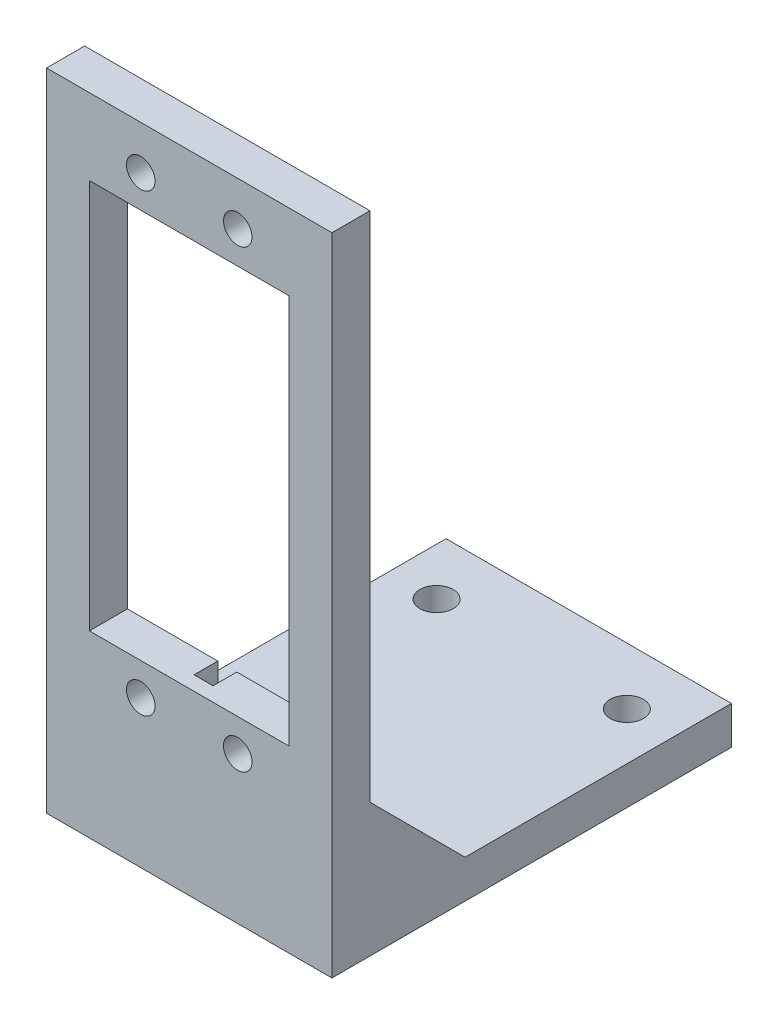
ISO-10303-21;
HEADER;
FILE_DESCRIPTION(('STEP AP214'),'2;1');
FILE_NAME('part.step','',(''),(''),'','','');
FILE_SCHEMA(('AUTOMOTIVE_DESIGN { 1 0 10303 214 1 1 1 1 }'));
ENDSEC;
DATA;
#1=APPLICATION_CONTEXT('core data for automotive mechanical design processes');
#2=APPLICATION_PROTOCOL_DEFINITION('international standard','automotive_design',2000,#1);
#3=PRODUCT_CONTEXT('',#1,'mechanical');
#4=PRODUCT('Part','Part','',(#3));
#5=PRODUCT_RELATED_PRODUCT_CATEGORY('part','',(#4));
#6=PRODUCT_DEFINITION_FORMATION('','',#4);
#7=PRODUCT_DEFINITION_CONTEXT('part definition',#1,'design');
#8=PRODUCT_DEFINITION('design','',#6,#7);
#9=PRODUCT_DEFINITION_SHAPE('','',#8);
#10=(LENGTH_UNIT() NAMED_UNIT(*) SI_UNIT(.MILLI.,.METRE.));
#11=(NAMED_UNIT(*) PLANE_ANGLE_UNIT() SI_UNIT($,.RADIAN.));
#12=(NAMED_UNIT(*) SI_UNIT($,.STERADIAN.) SOLID_ANGLE_UNIT());
#13=UNCERTAINTY_MEASURE_WITH_UNIT(LENGTH_MEASURE(1.E-05),#10,'distance_accuracy_value','');
#14=(GEOMETRIC_REPRESENTATION_CONTEXT(3) GLOBAL_UNCERTAINTY_ASSIGNED_CONTEXT((#13)) GLOBAL_UNIT_ASSIGNED_CONTEXT((#10,
#11,#12)) REPRESENTATION_CONTEXT('',''));
#15=CARTESIAN_POINT('',(0.,0.,0.));
#16=DIRECTION('',(0.,0.,1.));
#17=DIRECTION('',(1.,0.,0.));
#18=AXIS2_PLACEMENT_3D('',#15,#16,#17);
#19=CARTESIAN_POINT('',(0.,0.,4.));
#20=DIRECTION('',(0.,0.,-1.));
#21=DIRECTION('',(-1.,0.,0.));
#22=AXIS2_PLACEMENT_3D('',#19,#20,#21);
#23=PLANE('',#22);
#24=CARTESIAN_POINT('',(20.1,11.4558669001752,4.));
#25=DIRECTION('',(0.,0.,1.));
#26=DIRECTION('',(1.,0.,0.));
#27=AXIS2_PLACEMENT_3D('',#24,#25,#26);
#28=CIRCLE('',#27,1.5);
#29=CARTESIAN_POINT('',(21.6,11.4558669001752,4.));
#30=VERTEX_POINT('',#29);
#31=EDGE_CURVE('E305',#30,#30,#28,.T.);
#32=ORIENTED_EDGE('',*,*,#31,.F.);
#33=EDGE_LOOP('',(#32));
#34=FACE_BOUND('',#33,.T.);
#35=CARTESIAN_POINT('',(9.9,59.2558669001752,4.));
#36=DIRECTION('',(0.,0.,1.));
#37=DIRECTION('',(1.,0.,0.));
#38=AXIS2_PLACEMENT_3D('',#35,#36,#37);
#39=CIRCLE('',#38,1.5);
#40=CARTESIAN_POINT('',(11.4,59.2558669001752,4.));
#41=VERTEX_POINT('',#40);
#42=EDGE_CURVE('E317',#41,#41,#39,.T.);
#43=ORIENTED_EDGE('',*,*,#42,.F.);
#44=EDGE_LOOP('',(#43));
#45=FACE_BOUND('',#44,.T.);
#46=DIRECTION('',(0.,-1.,0.));
#47=VECTOR('',#46,1.);
#48=CARTESIAN_POINT('',(0.,0.,4.));
#49=LINE('',#48,#47);
#50=CARTESIAN_POINT('',(0.,63.8558669001752,4.));
#51=VERTEX_POINT('',#50);
#52=CARTESIAN_POINT('',(0.,-4.,4.));
#53=VERTEX_POINT('',#52);
#54=EDGE_CURVE('E352',#51,#53,#49,.T.);
#55=ORIENTED_EDGE('',*,*,#54,.T.);
#56=DIRECTION('',(-1.,0.,0.));
#57=VECTOR('',#56,1.);
#58=CARTESIAN_POINT('',(0.,-4.,4.));
#59=LINE('',#58,#57);
#60=CARTESIAN_POINT('',(30.,-4.,4.));
#61=VERTEX_POINT('',#60);
#62=EDGE_CURVE('E232',#61,#53,#59,.T.);
#63=ORIENTED_EDGE('',*,*,#62,.F.);
#64=DIRECTION('',(0.,1.,0.));
#65=VECTOR('',#64,1.);
#66=CARTESIAN_POINT('',(30.,0.,4.));
#67=LINE('',#66,#65);
#68=CARTESIAN_POINT('',(30.,63.8558669001752,4.));
#69=VERTEX_POINT('',#68);
#70=EDGE_CURVE('E354',#61,#69,#67,.T.);
#71=ORIENTED_EDGE('',*,*,#70,.T.);
#72=DIRECTION('',(-1.,0.,0.));
#73=VECTOR('',#72,1.);
#74=CARTESIAN_POINT('',(0.,63.8558669001752,4.));
#75=LINE('',#74,#73);
#76=EDGE_CURVE('E356',#69,#51,#75,.T.);
#77=ORIENTED_EDGE('',*,*,#76,.T.);
#78=EDGE_LOOP('',(#55,#63,#71,#77));
#79=FACE_BOUND('',#78,.T.);
#80=DIRECTION('',(0.,-1.,0.));
#81=VECTOR('',#80,1.);
#82=CARTESIAN_POINT('',(4.50000000000001,55.8558669001752,4.));
#83=LINE('',#82,#81);
#84=CARTESIAN_POINT('',(4.50000000000001,55.8558669001752,4.));
#85=VERTEX_POINT('',#84);
#86=CARTESIAN_POINT('',(4.50000000000001,14.8558669001752,4.));
#87=VERTEX_POINT('',#86);
#88=EDGE_CURVE('E323',#85,#87,#83,.T.);
#89=ORIENTED_EDGE('',*,*,#88,.F.);
#90=DIRECTION('',(-1.,0.,0.));
#91=VECTOR('',#90,1.);
#92=CARTESIAN_POINT('',(4.50000000000001,55.8558669001752,4.));
#93=LINE('',#92,#91);
#94=CARTESIAN_POINT('',(25.5,55.8558669001752,4.));
#95=VERTEX_POINT('',#94);
#96=EDGE_CURVE('E331',#95,#85,#93,.T.);
#97=ORIENTED_EDGE('',*,*,#96,.F.);
#98=DIRECTION('',(0.,1.,0.));
#99=VECTOR('',#98,1.);
#100=CARTESIAN_POINT('',(25.5,55.8558669001752,4.));
#101=LINE('',#100,#99);
#102=CARTESIAN_POINT('',(25.5,14.8558669001752,4.));
#103=VERTEX_POINT('',#102);
#104=EDGE_CURVE('E328',#103,#95,#101,.T.);
#105=ORIENTED_EDGE('',*,*,#104,.F.);
#106=DIRECTION('',(1.,0.,0.));
#107=VECTOR('',#106,1.);
#108=CARTESIAN_POINT('',(4.50000000000001,14.8558669001752,4.));
#109=LINE('',#108,#107);
#110=EDGE_CURVE('E325',#87,#103,#109,.T.);
#111=ORIENTED_EDGE('',*,*,#110,.F.);
#112=EDGE_LOOP('',(#89,#97,#105,#111));
#113=FACE_BOUND('',#112,.T.);
#114=CARTESIAN_POINT('',(20.1,59.2558669001752,4.));
#115=DIRECTION('',(0.,0.,1.));
#116=DIRECTION('',(-1.,0.,0.));
#117=AXIS2_PLACEMENT_3D('',#114,#115,#116);
#118=CIRCLE('',#117,1.5);
#119=CARTESIAN_POINT('',(18.6,59.2558669001752,4.));
#120=VERTEX_POINT('',#119);
#121=EDGE_CURVE('E311',#120,#120,#118,.T.);
#122=ORIENTED_EDGE('',*,*,#121,.F.);
#123=EDGE_LOOP('',(#122));
#124=FACE_BOUND('',#123,.T.);
#125=CARTESIAN_POINT('',(9.90000000000003,11.4558669001751,4.));
#126=DIRECTION('',(0.,0.,1.));
#127=DIRECTION('',(-1.,0.,0.));
#128=AXIS2_PLACEMENT_3D('',#125,#126,#127);
#129=CIRCLE('',#128,1.5);
#130=CARTESIAN_POINT('',(8.40000000000003,11.4558669001751,4.));
#131=VERTEX_POINT('',#130);
#132=EDGE_CURVE('E299',#131,#131,#129,.T.);
#133=ORIENTED_EDGE('',*,*,#132,.F.);
#134=EDGE_LOOP('',(#133));
#135=FACE_BOUND('',#134,.T.);
#136=ADVANCED_FACE('F33',(#34,#45,#79,#113,#124,#135),#23,.F.);
#137=CARTESIAN_POINT('',(0.,0.,0.));
#138=DIRECTION('',(0.,0.,-1.));
#139=DIRECTION('',(-1.,0.,0.));
#140=AXIS2_PLACEMENT_3D('',#137,#138,#139);
#141=PLANE('',#140);
#142=DIRECTION('',(-1.,0.,0.));
#143=VECTOR('',#142,1.);
#144=CARTESIAN_POINT('',(3.,10.,0.));
#145=LINE('',#144,#143);
#146=CARTESIAN_POINT('',(3.,10.,0.));
#147=VERTEX_POINT('',#146);
#148=CARTESIAN_POINT('',(0.,10.,0.));
#149=VERTEX_POINT('',#148);
#150=EDGE_CURVE('E367',#147,#149,#145,.T.);
#151=ORIENTED_EDGE('',*,*,#150,.T.);
#152=DIRECTION('',(0.,-1.,0.));
#153=VECTOR('',#152,1.);
#154=CARTESIAN_POINT('',(0.,0.,0.));
#155=LINE('',#154,#153);
#156=CARTESIAN_POINT('',(0.,63.8558669001752,0.));
#157=VERTEX_POINT('',#156);
#158=EDGE_CURVE('E211',#157,#149,#155,.T.);
#159=ORIENTED_EDGE('',*,*,#158,.F.);
#160=DIRECTION('',(-1.,0.,0.));
#161=VECTOR('',#160,1.);
#162=CARTESIAN_POINT('',(0.,63.8558669001752,0.));
#163=LINE('',#162,#161);
#164=CARTESIAN_POINT('',(30.,63.8558669001752,0.));
#165=VERTEX_POINT('',#164);
#166=EDGE_CURVE('E212',#165,#157,#163,.T.);
#167=ORIENTED_EDGE('',*,*,#166,.F.);
#168=DIRECTION('',(0.,1.,0.));
#169=VECTOR('',#168,1.);
#170=CARTESIAN_POINT('',(30.,0.,0.));
#171=LINE('',#170,#169);
#172=CARTESIAN_POINT('',(30.,10.,0.));
#173=VERTEX_POINT('',#172);
#174=EDGE_CURVE('E210',#173,#165,#171,.T.);
#175=ORIENTED_EDGE('',*,*,#174,.F.);
#176=DIRECTION('',(1.,0.,0.));
#177=VECTOR('',#176,1.);
#178=CARTESIAN_POINT('',(27.,10.,0.));
#179=LINE('',#178,#177);
#180=CARTESIAN_POINT('',(27.,10.,0.));
#181=VERTEX_POINT('',#180);
#182=EDGE_CURVE('E384',#181,#173,#179,.T.);
#183=ORIENTED_EDGE('',*,*,#182,.F.);
#184=DIRECTION('',(0.,-1.,0.));
#185=VECTOR('',#184,1.);
#186=CARTESIAN_POINT('',(27.,0.,0.));
#187=LINE('',#186,#185);
#188=CARTESIAN_POINT('',(27.,0.,0.));
#189=VERTEX_POINT('',#188);
#190=EDGE_CURVE('E209',#181,#189,#187,.T.);
#191=ORIENTED_EDGE('',*,*,#190,.T.);
#192=DIRECTION('',(1.,0.,0.));
#193=VECTOR('',#192,1.);
#194=CARTESIAN_POINT('',(0.,0.,0.));
#195=LINE('',#194,#193);
#196=CARTESIAN_POINT('',(3.,0.,0.));
#197=VERTEX_POINT('',#196);
#198=EDGE_CURVE('E37',#197,#189,#195,.T.);
#199=ORIENTED_EDGE('',*,*,#198,.F.);
#200=DIRECTION('',(0.,1.,0.));
#201=VECTOR('',#200,1.);
#202=CARTESIAN_POINT('',(3.,0.,0.));
#203=LINE('',#202,#201);
#204=EDGE_CURVE('E187',#197,#147,#203,.T.);
#205=ORIENTED_EDGE('',*,*,#204,.T.);
#206=EDGE_LOOP('',(#151,#159,#167,#175,#183,#191,#199,#205));
#207=FACE_BOUND('',#206,.T.);
#208=DIRECTION('',(0.,-1.,0.));
#209=VECTOR('',#208,1.);
#210=CARTESIAN_POINT('',(16.,14.8558669001752,0.));
#211=LINE('',#210,#209);
#212=CARTESIAN_POINT('',(16.,14.8558669001752,0.));
#213=VERTEX_POINT('',#212);
#214=CARTESIAN_POINT('',(16.,11.8558669001752,0.));
#215=VERTEX_POINT('',#214);
#216=EDGE_CURVE('E255',#213,#215,#211,.T.);
#217=ORIENTED_EDGE('',*,*,#216,.F.);
#218=DIRECTION('',(1.,0.,0.));
#219=VECTOR('',#218,1.);
#220=CARTESIAN_POINT('',(4.50000000000001,14.8558669001752,0.));
#221=LINE('',#220,#219);
#222=CARTESIAN_POINT('',(25.5,14.8558669001752,0.));
#223=VERTEX_POINT('',#222);
#224=EDGE_CURVE('E336',#213,#223,#221,.T.);
#225=ORIENTED_EDGE('',*,*,#224,.T.);
#226=DIRECTION('',(0.,1.,0.));
#227=VECTOR('',#226,1.);
#228=CARTESIAN_POINT('',(25.5,55.8558669001752,0.));
#229=LINE('',#228,#227);
#230=CARTESIAN_POINT('',(25.5,55.8558669001752,0.));
#231=VERTEX_POINT('',#230);
#232=EDGE_CURVE('E340',#223,#231,#229,.T.);
#233=ORIENTED_EDGE('',*,*,#232,.T.);
#234=DIRECTION('',(-1.,0.,0.));
#235=VECTOR('',#234,1.);
#236=CARTESIAN_POINT('',(4.50000000000001,55.8558669001752,0.));
#237=LINE('',#236,#235);
#238=CARTESIAN_POINT('',(16.,55.8558669001752,0.));
#239=VERTEX_POINT('',#238);
#240=EDGE_CURVE('E326',#231,#239,#237,.T.);
#241=ORIENTED_EDGE('',*,*,#240,.T.);
#242=DIRECTION('',(0.,-1.,0.));
#243=VECTOR('',#242,1.);
#244=CARTESIAN_POINT('',(16.,58.8558669001752,0.));
#245=LINE('',#244,#243);
#246=CARTESIAN_POINT('',(16.,58.8558669001752,0.));
#247=VERTEX_POINT('',#246);
#248=EDGE_CURVE('E264',#247,#239,#245,.T.);
#249=ORIENTED_EDGE('',*,*,#248,.F.);
#250=DIRECTION('',(1.,0.,0.));
#251=VECTOR('',#250,1.);
#252=CARTESIAN_POINT('',(16.,58.8558669001752,0.));
#253=LINE('',#252,#251);
#254=CARTESIAN_POINT('',(14.,58.8558669001752,0.));
#255=VERTEX_POINT('',#254);
#256=EDGE_CURVE('E274',#255,#247,#253,.T.);
#257=ORIENTED_EDGE('',*,*,#256,.F.);
#258=DIRECTION('',(0.,1.,0.));
#259=VECTOR('',#258,1.);
#260=CARTESIAN_POINT('',(14.,58.8558669001752,0.));
#261=LINE('',#260,#259);
#262=CARTESIAN_POINT('',(14.,55.8558669001752,0.));
#263=VERTEX_POINT('',#262);
#264=EDGE_CURVE('E285',#263,#255,#261,.T.);
#265=ORIENTED_EDGE('',*,*,#264,.F.);
#266=CARTESIAN_POINT('',(4.50000000000001,55.8558669001752,0.));
#267=VERTEX_POINT('',#266);
#268=EDGE_CURVE('E343',#263,#267,#237,.T.);
#269=ORIENTED_EDGE('',*,*,#268,.T.);
#270=DIRECTION('',(0.,-1.,0.));
#271=VECTOR('',#270,1.);
#272=CARTESIAN_POINT('',(4.50000000000001,55.8558669001752,0.));
#273=LINE('',#272,#271);
#274=CARTESIAN_POINT('',(4.50000000000001,14.8558669001752,0.));
#275=VERTEX_POINT('',#274);
#276=EDGE_CURVE('E320',#267,#275,#273,.T.);
#277=ORIENTED_EDGE('',*,*,#276,.T.);
#278=CARTESIAN_POINT('',(14.,14.8558669001752,0.));
#279=VERTEX_POINT('',#278);
#280=EDGE_CURVE('E337',#275,#279,#221,.T.);
#281=ORIENTED_EDGE('',*,*,#280,.T.);
#282=DIRECTION('',(0.,1.,0.));
#283=VECTOR('',#282,1.);
#284=CARTESIAN_POINT('',(14.,14.8558669001752,0.));
#285=LINE('',#284,#283);
#286=CARTESIAN_POINT('',(14.,11.8558669001752,0.));
#287=VERTEX_POINT('',#286);
#288=EDGE_CURVE('E249',#287,#279,#285,.T.);
#289=ORIENTED_EDGE('',*,*,#288,.F.);
#290=DIRECTION('',(-1.,0.,0.));
#291=VECTOR('',#290,1.);
#292=CARTESIAN_POINT('',(16.,11.8558669001752,0.));
#293=LINE('',#292,#291);
#294=EDGE_CURVE('E258',#215,#287,#293,.T.);
#295=ORIENTED_EDGE('',*,*,#294,.F.);
#296=EDGE_LOOP('',(#217,#225,#233,#241,#249,#257,#265,#269,#277,#281,#289,#295));
#297=FACE_BOUND('',#296,.T.);
#298=CARTESIAN_POINT('',(20.1,11.4558669001752,0.));
#299=DIRECTION('',(0.,0.,1.));
#300=DIRECTION('',(1.,0.,0.));
#301=AXIS2_PLACEMENT_3D('',#298,#299,#300);
#302=CIRCLE('',#301,1.5);
#303=CARTESIAN_POINT('',(21.6,11.4558669001752,0.));
#304=VERTEX_POINT('',#303);
#305=EDGE_CURVE('E302',#304,#304,#302,.T.);
#306=ORIENTED_EDGE('',*,*,#305,.T.);
#307=EDGE_LOOP('',(#306));
#308=FACE_BOUND('',#307,.T.);
#309=CARTESIAN_POINT('',(9.9,59.2558669001752,0.));
#310=DIRECTION('',(0.,0.,1.));
#311=DIRECTION('',(1.,0.,0.));
#312=AXIS2_PLACEMENT_3D('',#309,#310,#311);
#313=CIRCLE('',#312,1.5);
#314=CARTESIAN_POINT('',(11.4,59.2558669001752,0.));
#315=VERTEX_POINT('',#314);
#316=EDGE_CURVE('E314',#315,#315,#313,.T.);
#317=ORIENTED_EDGE('',*,*,#316,.T.);
#318=EDGE_LOOP('',(#317));
#319=FACE_BOUND('',#318,.T.);
#320=CARTESIAN_POINT('',(20.1,59.2558669001752,0.));
#321=DIRECTION('',(0.,0.,1.));
#322=DIRECTION('',(-1.,0.,0.));
#323=AXIS2_PLACEMENT_3D('',#320,#321,#322);
#324=CIRCLE('',#323,1.5);
#325=CARTESIAN_POINT('',(18.6,59.2558669001752,0.));
#326=VERTEX_POINT('',#325);
#327=EDGE_CURVE('E308',#326,#326,#324,.T.);
#328=ORIENTED_EDGE('',*,*,#327,.T.);
#329=EDGE_LOOP('',(#328));
#330=FACE_BOUND('',#329,.T.);
#331=CARTESIAN_POINT('',(9.90000000000003,11.4558669001751,0.));
#332=DIRECTION('',(0.,0.,1.));
#333=DIRECTION('',(-1.,0.,0.));
#334=AXIS2_PLACEMENT_3D('',#331,#332,#333);
#335=CIRCLE('',#334,1.5);
#336=CARTESIAN_POINT('',(8.40000000000003,11.4558669001751,0.));
#337=VERTEX_POINT('',#336);
#338=EDGE_CURVE('E292',#337,#337,#335,.T.);
#339=ORIENTED_EDGE('',*,*,#338,.T.);
#340=EDGE_LOOP('',(#339));
#341=FACE_BOUND('',#340,.T.);
#342=ADVANCED_FACE('F206',(#207,#297,#308,#319,#330,#341),#141,.T.);
#343=CARTESIAN_POINT('',(0.,0.,4.));
#344=DIRECTION('',(1.,0.,0.));
#345=DIRECTION('',(0.,0.,-1.));
#346=AXIS2_PLACEMENT_3D('',#343,#344,#345);
#347=PLANE('',#346);
#348=ORIENTED_EDGE('',*,*,#158,.T.);
#349=DIRECTION('',(0.,-0.707106781186548,-0.707106781186547));
#350=VECTOR('',#349,1.);
#351=CARTESIAN_POINT('',(0.,10.,0.));
#352=LINE('',#351,#350);
#353=CARTESIAN_POINT('',(0.,0.,-10.));
#354=VERTEX_POINT('',#353);
#355=EDGE_CURVE('E51',#149,#354,#352,.T.);
#356=ORIENTED_EDGE('',*,*,#355,.T.);
#357=DIRECTION('',(0.,0.,-1.));
#358=VECTOR('',#357,1.);
#359=CARTESIAN_POINT('',(0.,0.,4.));
#360=LINE('',#359,#358);
#361=CARTESIAN_POINT('',(0.,0.,-38.));
#362=VERTEX_POINT('',#361);
#363=EDGE_CURVE('E225',#354,#362,#360,.T.);
#364=ORIENTED_EDGE('',*,*,#363,.T.);
#365=DIRECTION('',(0.,1.,0.));
#366=VECTOR('',#365,1.);
#367=CARTESIAN_POINT('',(0.,-4.,-38.));
#368=LINE('',#367,#366);
#369=CARTESIAN_POINT('',(0.,-4.,-38.));
#370=VERTEX_POINT('',#369);
#371=EDGE_CURVE('E244',#370,#362,#368,.T.);
#372=ORIENTED_EDGE('',*,*,#371,.F.);
#373=DIRECTION('',(0.,0.,-1.));
#374=VECTOR('',#373,1.);
#375=CARTESIAN_POINT('',(0.,-4.,4.));
#376=LINE('',#375,#374);
#377=EDGE_CURVE('E243',#53,#370,#376,.T.);
#378=ORIENTED_EDGE('',*,*,#377,.F.);
#379=ORIENTED_EDGE('',*,*,#54,.F.);
#380=DIRECTION('',(0.,0.,-1.));
#381=VECTOR('',#380,1.);
#382=CARTESIAN_POINT('',(0.,63.8558669001752,4.));
#383=LINE('',#382,#381);
#384=EDGE_CURVE('E43',#51,#157,#383,.T.);
#385=ORIENTED_EDGE('',*,*,#384,.T.);
#386=EDGE_LOOP('',(#348,#356,#364,#372,#378,#379,#385));
#387=FACE_BOUND('',#386,.T.);
#388=ADVANCED_FACE('F35',(#387),#347,.F.);
#389=CARTESIAN_POINT('',(30.,0.,4.));
#390=DIRECTION('',(-1.,0.,0.));
#391=DIRECTION('',(0.,-1.,0.));
#392=AXIS2_PLACEMENT_3D('',#389,#390,#391);
#393=PLANE('',#392);
#394=DIRECTION('',(0.,0.707106781186548,0.707106781186547));
#395=VECTOR('',#394,1.);
#396=CARTESIAN_POINT('',(30.,10.,0.));
#397=LINE('',#396,#395);
#398=CARTESIAN_POINT('',(30.,0.,-10.));
#399=VERTEX_POINT('',#398);
#400=EDGE_CURVE('E370',#399,#173,#397,.T.);
#401=ORIENTED_EDGE('',*,*,#400,.T.);
#402=ORIENTED_EDGE('',*,*,#174,.T.);
#403=DIRECTION('',(0.,0.,-1.));
#404=VECTOR('',#403,1.);
#405=CARTESIAN_POINT('',(30.,63.8558669001752,4.));
#406=LINE('',#405,#404);
#407=EDGE_CURVE('E11',#69,#165,#406,.T.);
#408=ORIENTED_EDGE('',*,*,#407,.F.);
#409=ORIENTED_EDGE('',*,*,#70,.F.);
#410=DIRECTION('',(0.,0.,1.));
#411=VECTOR('',#410,1.);
#412=CARTESIAN_POINT('',(30.,-4.,4.));
#413=LINE('',#412,#411);
#414=CARTESIAN_POINT('',(30.,-4.,-38.));
#415=VERTEX_POINT('',#414);
#416=EDGE_CURVE('E402',#415,#61,#413,.T.);
#417=ORIENTED_EDGE('',*,*,#416,.F.);
#418=DIRECTION('',(0.,1.,0.));
#419=VECTOR('',#418,1.);
#420=CARTESIAN_POINT('',(30.,-4.,-38.));
#421=LINE('',#420,#419);
#422=CARTESIAN_POINT('',(30.,0.,-38.));
#423=VERTEX_POINT('',#422);
#424=EDGE_CURVE('E238',#415,#423,#421,.T.);
#425=ORIENTED_EDGE('',*,*,#424,.T.);
#426=DIRECTION('',(0.,0.,1.));
#427=VECTOR('',#426,1.);
#428=CARTESIAN_POINT('',(30.,0.,4.));
#429=LINE('',#428,#427);
#430=EDGE_CURVE('E235',#423,#399,#429,.T.);
#431=ORIENTED_EDGE('',*,*,#430,.T.);
#432=EDGE_LOOP('',(#401,#402,#408,#409,#417,#425,#431));
#433=FACE_BOUND('',#432,.T.);
#434=ADVANCED_FACE('F417',(#433),#393,.F.);
#435=CARTESIAN_POINT('',(0.,63.8558669001752,4.));
#436=DIRECTION('',(0.,-1.,0.));
#437=DIRECTION('',(0.,0.,-1.));
#438=AXIS2_PLACEMENT_3D('',#435,#436,#437);
#439=PLANE('',#438);
#440=ORIENTED_EDGE('',*,*,#166,.T.);
#441=ORIENTED_EDGE('',*,*,#384,.F.);
#442=ORIENTED_EDGE('',*,*,#76,.F.);
#443=ORIENTED_EDGE('',*,*,#407,.T.);
#444=EDGE_LOOP('',(#440,#441,#442,#443));
#445=FACE_BOUND('',#444,.T.);
#446=ADVANCED_FACE('F447',(#445),#439,.F.);
#447=CARTESIAN_POINT('',(4.50000000000001,55.8558669001752,4.));
#448=DIRECTION('',(1.,0.,0.));
#449=DIRECTION('',(0.,0.,-1.));
#450=AXIS2_PLACEMENT_3D('',#447,#448,#449);
#451=PLANE('',#450);
#452=ORIENTED_EDGE('',*,*,#276,.F.);
#453=DIRECTION('',(0.,0.,-1.));
#454=VECTOR('',#453,1.);
#455=CARTESIAN_POINT('',(4.50000000000001,55.8558669001752,4.));
#456=LINE('',#455,#454);
#457=EDGE_CURVE('E333',#85,#267,#456,.T.);
#458=ORIENTED_EDGE('',*,*,#457,.F.);
#459=ORIENTED_EDGE('',*,*,#88,.T.);
#460=DIRECTION('',(0.,0.,-1.));
#461=VECTOR('',#460,1.);
#462=CARTESIAN_POINT('',(4.50000000000001,14.8558669001752,4.));
#463=LINE('',#462,#461);
#464=EDGE_CURVE('E214',#87,#275,#463,.T.);
#465=ORIENTED_EDGE('',*,*,#464,.T.);
#466=EDGE_LOOP('',(#452,#458,#459,#465));
#467=FACE_BOUND('',#466,.T.);
#468=ADVANCED_FACE('F444',(#467),#451,.T.);
#469=CARTESIAN_POINT('',(4.50000000000001,14.8558669001752,4.));
#470=DIRECTION('',(0.,1.,0.));
#471=DIRECTION('',(-1.,0.,0.));
#472=AXIS2_PLACEMENT_3D('',#469,#470,#471);
#473=PLANE('',#472);
#474=DIRECTION('',(0.,0.,-1.));
#475=VECTOR('',#474,1.);
#476=CARTESIAN_POINT('',(16.,14.8558669001752,2.5));
#477=LINE('',#476,#475);
#478=CARTESIAN_POINT('',(16.,14.8558669001752,2.5));
#479=VERTEX_POINT('',#478);
#480=EDGE_CURVE('E262',#479,#213,#477,.T.);
#481=ORIENTED_EDGE('',*,*,#480,.F.);
#482=DIRECTION('',(1.,0.,0.));
#483=VECTOR('',#482,1.);
#484=CARTESIAN_POINT('',(16.,14.8558669001752,2.5));
#485=LINE('',#484,#483);
#486=CARTESIAN_POINT('',(14.,14.8558669001752,2.5));
#487=VERTEX_POINT('',#486);
#488=EDGE_CURVE('E252',#487,#479,#485,.T.);
#489=ORIENTED_EDGE('',*,*,#488,.F.);
#490=DIRECTION('',(0.,0.,-1.));
#491=VECTOR('',#490,1.);
#492=CARTESIAN_POINT('',(14.,14.8558669001752,2.5));
#493=LINE('',#492,#491);
#494=EDGE_CURVE('E265',#487,#279,#493,.T.);
#495=ORIENTED_EDGE('',*,*,#494,.T.);
#496=ORIENTED_EDGE('',*,*,#280,.F.);
#497=ORIENTED_EDGE('',*,*,#464,.F.);
#498=ORIENTED_EDGE('',*,*,#110,.T.);
#499=DIRECTION('',(0.,0.,-1.));
#500=VECTOR('',#499,1.);
#501=CARTESIAN_POINT('',(25.5,14.8558669001752,4.));
#502=LINE('',#501,#500);
#503=EDGE_CURVE('E219',#103,#223,#502,.T.);
#504=ORIENTED_EDGE('',*,*,#503,.T.);
#505=ORIENTED_EDGE('',*,*,#224,.F.);
#506=EDGE_LOOP('',(#481,#489,#495,#496,#497,#498,#504,#505));
#507=FACE_BOUND('',#506,.T.);
#508=ADVANCED_FACE('F624',(#507),#473,.T.);
#509=CARTESIAN_POINT('',(25.5,55.8558669001752,4.));
#510=DIRECTION('',(-1.,0.,0.));
#511=DIRECTION('',(0.,0.,1.));
#512=AXIS2_PLACEMENT_3D('',#509,#510,#511);
#513=PLANE('',#512);
#514=ORIENTED_EDGE('',*,*,#232,.F.);
#515=ORIENTED_EDGE('',*,*,#503,.F.);
#516=ORIENTED_EDGE('',*,*,#104,.T.);
#517=DIRECTION('',(0.,0.,-1.));
#518=VECTOR('',#517,1.);
#519=CARTESIAN_POINT('',(25.5,55.8558669001752,4.));
#520=LINE('',#519,#518);
#521=EDGE_CURVE('E348',#95,#231,#520,.T.);
#522=ORIENTED_EDGE('',*,*,#521,.T.);
#523=EDGE_LOOP('',(#514,#515,#516,#522));
#524=FACE_BOUND('',#523,.T.);
#525=ADVANCED_FACE('F614',(#524),#513,.T.);
#526=CARTESIAN_POINT('',(4.50000000000001,55.8558669001752,4.));
#527=DIRECTION('',(0.,-1.,0.));
#528=DIRECTION('',(0.,0.,-1.));
#529=AXIS2_PLACEMENT_3D('',#526,#527,#528);
#530=PLANE('',#529);
#531=DIRECTION('',(0.,0.,-1.));
#532=VECTOR('',#531,1.);
#533=CARTESIAN_POINT('',(16.,55.8558669001752,2.5));
#534=LINE('',#533,#532);
#535=CARTESIAN_POINT('',(16.,55.8558669001752,2.5));
#536=VERTEX_POINT('',#535);
#537=EDGE_CURVE('E283',#536,#239,#534,.T.);
#538=ORIENTED_EDGE('',*,*,#537,.T.);
#539=ORIENTED_EDGE('',*,*,#240,.F.);
#540=ORIENTED_EDGE('',*,*,#521,.F.);
#541=ORIENTED_EDGE('',*,*,#96,.T.);
#542=ORIENTED_EDGE('',*,*,#457,.T.);
#543=ORIENTED_EDGE('',*,*,#268,.F.);
#544=DIRECTION('',(0.,0.,-1.));
#545=VECTOR('',#544,1.);
#546=CARTESIAN_POINT('',(14.,55.8558669001752,2.5));
#547=LINE('',#546,#545);
#548=CARTESIAN_POINT('',(14.,55.8558669001752,2.5));
#549=VERTEX_POINT('',#548);
#550=EDGE_CURVE('E295',#549,#263,#547,.T.);
#551=ORIENTED_EDGE('',*,*,#550,.F.);
#552=DIRECTION('',(-1.,0.,0.));
#553=VECTOR('',#552,1.);
#554=CARTESIAN_POINT('',(16.,55.8558669001752,2.5));
#555=LINE('',#554,#553);
#556=EDGE_CURVE('E273',#536,#549,#555,.T.);
#557=ORIENTED_EDGE('',*,*,#556,.F.);
#558=EDGE_LOOP('',(#538,#539,#540,#541,#542,#543,#551,#557));
#559=FACE_BOUND('',#558,.T.);
#560=ADVANCED_FACE('F608',(#559),#530,.T.);
#561=CARTESIAN_POINT('',(9.9,59.2558669001752,4.));
#562=DIRECTION('',(0.,0.,-1.));
#563=DIRECTION('',(-1.,0.,0.));
#564=AXIS2_PLACEMENT_3D('',#561,#562,#563);
#565=CYLINDRICAL_SURFACE('',#564,1.5);
#566=ORIENTED_EDGE('',*,*,#42,.T.);
#567=EDGE_LOOP('',(#566));
#568=FACE_BOUND('',#567,.T.);
#569=ORIENTED_EDGE('',*,*,#316,.F.);
#570=EDGE_LOOP('',(#569));
#571=FACE_BOUND('',#570,.T.);
#572=ADVANCED_FACE('F613',(#568,#571),#565,.F.);
#573=CARTESIAN_POINT('',(20.1,59.2558669001752,4.));
#574=DIRECTION('',(0.,0.,-1.));
#575=DIRECTION('',(-1.,0.,0.));
#576=AXIS2_PLACEMENT_3D('',#573,#574,#575);
#577=CYLINDRICAL_SURFACE('',#576,1.5);
#578=ORIENTED_EDGE('',*,*,#121,.T.);
#579=EDGE_LOOP('',(#578));
#580=FACE_BOUND('',#579,.T.);
#581=ORIENTED_EDGE('',*,*,#327,.F.);
#582=EDGE_LOOP('',(#581));
#583=FACE_BOUND('',#582,.T.);
#584=ADVANCED_FACE('F647',(#580,#583),#577,.F.);
#585=CARTESIAN_POINT('',(20.1,11.4558669001752,4.));
#586=DIRECTION('',(0.,0.,-1.));
#587=DIRECTION('',(-1.,0.,0.));
#588=AXIS2_PLACEMENT_3D('',#585,#586,#587);
#589=CYLINDRICAL_SURFACE('',#588,1.5);
#590=ORIENTED_EDGE('',*,*,#31,.T.);
#591=EDGE_LOOP('',(#590));
#592=FACE_BOUND('',#591,.T.);
#593=ORIENTED_EDGE('',*,*,#305,.F.);
#594=EDGE_LOOP('',(#593));
#595=FACE_BOUND('',#594,.T.);
#596=ADVANCED_FACE('F637',(#592,#595),#589,.F.);
#597=CARTESIAN_POINT('',(9.90000000000003,11.4558669001751,4.));
#598=DIRECTION('',(0.,0.,-1.));
#599=DIRECTION('',(-1.,0.,0.));
#600=AXIS2_PLACEMENT_3D('',#597,#598,#599);
#601=CYLINDRICAL_SURFACE('',#600,1.5);
#602=ORIENTED_EDGE('',*,*,#132,.T.);
#603=EDGE_LOOP('',(#602));
#604=FACE_BOUND('',#603,.T.);
#605=ORIENTED_EDGE('',*,*,#338,.F.);
#606=EDGE_LOOP('',(#605));
#607=FACE_BOUND('',#606,.T.);
#608=ADVANCED_FACE('F600',(#604,#607),#601,.F.);
#609=CARTESIAN_POINT('',(16.,58.8558669001752,2.5));
#610=DIRECTION('',(1.,0.,0.));
#611=DIRECTION('',(0.,0.,-1.));
#612=AXIS2_PLACEMENT_3D('',#609,#610,#611);
#613=PLANE('',#612);
#614=ORIENTED_EDGE('',*,*,#248,.T.);
#615=ORIENTED_EDGE('',*,*,#537,.F.);
#616=DIRECTION('',(0.,-1.,0.));
#617=VECTOR('',#616,1.);
#618=CARTESIAN_POINT('',(16.,58.8558669001752,2.5));
#619=LINE('',#618,#617);
#620=CARTESIAN_POINT('',(16.,58.8558669001752,2.5));
#621=VERTEX_POINT('',#620);
#622=EDGE_CURVE('E271',#621,#536,#619,.T.);
#623=ORIENTED_EDGE('',*,*,#622,.F.);
#624=DIRECTION('',(0.,0.,-1.));
#625=VECTOR('',#624,1.);
#626=CARTESIAN_POINT('',(16.,58.8558669001752,2.5));
#627=LINE('',#626,#625);
#628=EDGE_CURVE('E290',#621,#247,#627,.T.);
#629=ORIENTED_EDGE('',*,*,#628,.T.);
#630=EDGE_LOOP('',(#614,#615,#623,#629));
#631=FACE_BOUND('',#630,.T.);
#632=ADVANCED_FACE('F590',(#631),#613,.F.);
#633=CARTESIAN_POINT('',(16.,58.8558669001752,2.5));
#634=DIRECTION('',(0.,1.,0.));
#635=DIRECTION('',(0.,0.,1.));
#636=AXIS2_PLACEMENT_3D('',#633,#634,#635);
#637=PLANE('',#636);
#638=ORIENTED_EDGE('',*,*,#256,.T.);
#639=ORIENTED_EDGE('',*,*,#628,.F.);
#640=DIRECTION('',(1.,0.,0.));
#641=VECTOR('',#640,1.);
#642=CARTESIAN_POINT('',(16.,58.8558669001752,2.5));
#643=LINE('',#642,#641);
#644=CARTESIAN_POINT('',(14.,58.8558669001752,2.5));
#645=VERTEX_POINT('',#644);
#646=EDGE_CURVE('E280',#645,#621,#643,.T.);
#647=ORIENTED_EDGE('',*,*,#646,.F.);
#648=DIRECTION('',(0.,0.,-1.));
#649=VECTOR('',#648,1.);
#650=CARTESIAN_POINT('',(14.,58.8558669001752,2.5));
#651=LINE('',#650,#649);
#652=EDGE_CURVE('E293',#645,#255,#651,.T.);
#653=ORIENTED_EDGE('',*,*,#652,.T.);
#654=EDGE_LOOP('',(#638,#639,#647,#653));
#655=FACE_BOUND('',#654,.T.);
#656=ADVANCED_FACE('F580',(#655),#637,.F.);
#657=CARTESIAN_POINT('',(14.,58.8558669001752,2.5));
#658=DIRECTION('',(-1.,0.,0.));
#659=DIRECTION('',(0.,0.,1.));
#660=AXIS2_PLACEMENT_3D('',#657,#658,#659);
#661=PLANE('',#660);
#662=ORIENTED_EDGE('',*,*,#264,.T.);
#663=ORIENTED_EDGE('',*,*,#652,.F.);
#664=DIRECTION('',(0.,1.,0.));
#665=VECTOR('',#664,1.);
#666=CARTESIAN_POINT('',(14.,58.8558669001752,2.5));
#667=LINE('',#666,#665);
#668=EDGE_CURVE('E277',#549,#645,#667,.T.);
#669=ORIENTED_EDGE('',*,*,#668,.F.);
#670=ORIENTED_EDGE('',*,*,#550,.T.);
#671=EDGE_LOOP('',(#662,#663,#669,#670));
#672=FACE_BOUND('',#671,.T.);
#673=ADVANCED_FACE('F570',(#672),#661,.F.);
#674=CARTESIAN_POINT('',(0.,0.,2.5));
#675=DIRECTION('',(0.,0.,-1.));
#676=DIRECTION('',(-1.,0.,0.));
#677=AXIS2_PLACEMENT_3D('',#674,#675,#676);
#678=PLANE('',#677);
#679=ORIENTED_EDGE('',*,*,#622,.T.);
#680=ORIENTED_EDGE('',*,*,#556,.T.);
#681=ORIENTED_EDGE('',*,*,#668,.T.);
#682=ORIENTED_EDGE('',*,*,#646,.T.);
#683=EDGE_LOOP('',(#679,#680,#681,#682));
#684=FACE_BOUND('',#683,.T.);
#685=ADVANCED_FACE('F560',(#684),#678,.T.);
#686=CARTESIAN_POINT('',(16.,14.8558669001752,2.5));
#687=DIRECTION('',(1.,0.,0.));
#688=DIRECTION('',(0.,0.,-1.));
#689=AXIS2_PLACEMENT_3D('',#686,#687,#688);
#690=PLANE('',#689);
#691=ORIENTED_EDGE('',*,*,#216,.T.);
#692=DIRECTION('',(0.,0.,-1.));
#693=VECTOR('',#692,1.);
#694=CARTESIAN_POINT('',(16.,11.8558669001752,2.5));
#695=LINE('',#694,#693);
#696=CARTESIAN_POINT('',(16.,11.8558669001752,2.5));
#697=VERTEX_POINT('',#696);
#698=EDGE_CURVE('E254',#697,#215,#695,.T.);
#699=ORIENTED_EDGE('',*,*,#698,.F.);
#700=DIRECTION('',(0.,-1.,0.));
#701=VECTOR('',#700,1.);
#702=CARTESIAN_POINT('',(16.,14.8558669001752,2.5));
#703=LINE('',#702,#701);
#704=EDGE_CURVE('E245',#479,#697,#703,.T.);
#705=ORIENTED_EDGE('',*,*,#704,.F.);
#706=ORIENTED_EDGE('',*,*,#480,.T.);
#707=EDGE_LOOP('',(#691,#699,#705,#706));
#708=FACE_BOUND('',#707,.T.);
#709=ADVANCED_FACE('F550',(#708),#690,.F.);
#710=CARTESIAN_POINT('',(14.,14.8558669001752,2.5));
#711=DIRECTION('',(-1.,0.,0.));
#712=DIRECTION('',(0.,0.,1.));
#713=AXIS2_PLACEMENT_3D('',#710,#711,#712);
#714=PLANE('',#713);
#715=ORIENTED_EDGE('',*,*,#288,.T.);
#716=ORIENTED_EDGE('',*,*,#494,.F.);
#717=DIRECTION('',(0.,1.,0.));
#718=VECTOR('',#717,1.);
#719=CARTESIAN_POINT('',(14.,14.8558669001752,2.5));
#720=LINE('',#719,#718);
#721=CARTESIAN_POINT('',(14.,11.8558669001752,2.5));
#722=VERTEX_POINT('',#721);
#723=EDGE_CURVE('E59',#722,#487,#720,.T.);
#724=ORIENTED_EDGE('',*,*,#723,.F.);
#725=DIRECTION('',(0.,0.,-1.));
#726=VECTOR('',#725,1.);
#727=CARTESIAN_POINT('',(14.,11.8558669001752,2.5));
#728=LINE('',#727,#726);
#729=EDGE_CURVE('E268',#722,#287,#728,.T.);
#730=ORIENTED_EDGE('',*,*,#729,.T.);
#731=EDGE_LOOP('',(#715,#716,#724,#730));
#732=FACE_BOUND('',#731,.T.);
#733=ADVANCED_FACE('F540',(#732),#714,.F.);
#734=CARTESIAN_POINT('',(16.,11.8558669001752,2.5));
#735=DIRECTION('',(0.,-1.,0.));
#736=DIRECTION('',(0.,0.,-1.));
#737=AXIS2_PLACEMENT_3D('',#734,#735,#736);
#738=PLANE('',#737);
#739=ORIENTED_EDGE('',*,*,#294,.T.);
#740=ORIENTED_EDGE('',*,*,#729,.F.);
#741=DIRECTION('',(-1.,0.,0.));
#742=VECTOR('',#741,1.);
#743=CARTESIAN_POINT('',(16.,11.8558669001752,2.5));
#744=LINE('',#743,#742);
#745=EDGE_CURVE('E248',#697,#722,#744,.T.);
#746=ORIENTED_EDGE('',*,*,#745,.F.);
#747=ORIENTED_EDGE('',*,*,#698,.T.);
#748=EDGE_LOOP('',(#739,#740,#746,#747));
#749=FACE_BOUND('',#748,.T.);
#750=ADVANCED_FACE('F531',(#749),#738,.F.);
#751=CARTESIAN_POINT('',(0.,0.,2.5));
#752=DIRECTION('',(0.,0.,-1.));
#753=DIRECTION('',(-1.,0.,0.));
#754=AXIS2_PLACEMENT_3D('',#751,#752,#753);
#755=PLANE('',#754);
#756=ORIENTED_EDGE('',*,*,#704,.T.);
#757=ORIENTED_EDGE('',*,*,#745,.T.);
#758=ORIENTED_EDGE('',*,*,#723,.T.);
#759=ORIENTED_EDGE('',*,*,#488,.T.);
#760=EDGE_LOOP('',(#756,#757,#758,#759));
#761=FACE_BOUND('',#760,.T.);
#762=ADVANCED_FACE('F527',(#761),#755,.T.);
#763=CARTESIAN_POINT('',(0.,0.,0.));
#764=DIRECTION('',(0.,-1.,0.));
#765=DIRECTION('',(0.,0.,-1.));
#766=AXIS2_PLACEMENT_3D('',#763,#764,#765);
#767=PLANE('',#766);
#768=CARTESIAN_POINT('',(25.,0.,-32.));
#769=DIRECTION('',(0.,1.,0.));
#770=DIRECTION('',(0.,0.,-1.));
#771=AXIS2_PLACEMENT_3D('',#768,#769,#770);
#772=CIRCLE('',#771,1.75);
#773=CARTESIAN_POINT('',(25.,0.,-33.75));
#774=VERTEX_POINT('',#773);
#775=EDGE_CURVE('E386',#774,#774,#772,.T.);
#776=ORIENTED_EDGE('',*,*,#775,.F.);
#777=EDGE_LOOP('',(#776));
#778=FACE_BOUND('',#777,.T.);
#779=CARTESIAN_POINT('',(4.99999999999999,0.,-32.));
#780=DIRECTION('',(0.,1.,0.));
#781=DIRECTION('',(0.,0.,1.));
#782=AXIS2_PLACEMENT_3D('',#779,#780,#781);
#783=CIRCLE('',#782,1.75);
#784=CARTESIAN_POINT('',(4.99999999999999,0.,-30.25));
#785=VERTEX_POINT('',#784);
#786=EDGE_CURVE('E392',#785,#785,#783,.T.);
#787=ORIENTED_EDGE('',*,*,#786,.F.);
#788=EDGE_LOOP('',(#787));
#789=FACE_BOUND('',#788,.T.);
#790=ORIENTED_EDGE('',*,*,#363,.F.);
#791=DIRECTION('',(-1.,0.,0.));
#792=VECTOR('',#791,1.);
#793=CARTESIAN_POINT('',(3.,0.,-10.));
#794=LINE('',#793,#792);
#795=CARTESIAN_POINT('',(3.,0.,-10.));
#796=VERTEX_POINT('',#795);
#797=EDGE_CURVE('E203',#796,#354,#794,.T.);
#798=ORIENTED_EDGE('',*,*,#797,.F.);
#799=DIRECTION('',(0.,0.,1.));
#800=VECTOR('',#799,1.);
#801=CARTESIAN_POINT('',(3.,0.,-10.));
#802=LINE('',#801,#800);
#803=EDGE_CURVE('E190',#796,#197,#802,.T.);
#804=ORIENTED_EDGE('',*,*,#803,.T.);
#805=ORIENTED_EDGE('',*,*,#198,.T.);
#806=DIRECTION('',(0.,0.,-1.));
#807=VECTOR('',#806,1.);
#808=CARTESIAN_POINT('',(27.,0.,-10.));
#809=LINE('',#808,#807);
#810=CARTESIAN_POINT('',(27.,0.,-10.));
#811=VERTEX_POINT('',#810);
#812=EDGE_CURVE('E376',#189,#811,#809,.T.);
#813=ORIENTED_EDGE('',*,*,#812,.T.);
#814=DIRECTION('',(1.,0.,0.));
#815=VECTOR('',#814,1.);
#816=CARTESIAN_POINT('',(27.,0.,-10.));
#817=LINE('',#816,#815);
#818=EDGE_CURVE('E381',#811,#399,#817,.T.);
#819=ORIENTED_EDGE('',*,*,#818,.T.);
#820=ORIENTED_EDGE('',*,*,#430,.F.);
#821=DIRECTION('',(1.,0.,0.));
#822=VECTOR('',#821,1.);
#823=CARTESIAN_POINT('',(0.,0.,-38.));
#824=LINE('',#823,#822);
#825=EDGE_CURVE('E227',#362,#423,#824,.T.);
#826=ORIENTED_EDGE('',*,*,#825,.F.);
#827=EDGE_LOOP('',(#790,#798,#804,#805,#813,#819,#820,#826));
#828=FACE_BOUND('',#827,.T.);
#829=ADVANCED_FACE('F200',(#778,#789,#828),#767,.F.);
#830=CARTESIAN_POINT('',(0.,-4.,-38.));
#831=DIRECTION('',(0.,0.,1.));
#832=DIRECTION('',(1.,0.,0.));
#833=AXIS2_PLACEMENT_3D('',#830,#831,#832);
#834=PLANE('',#833);
#835=ORIENTED_EDGE('',*,*,#825,.T.);
#836=ORIENTED_EDGE('',*,*,#424,.F.);
#837=DIRECTION('',(1.,0.,0.));
#838=VECTOR('',#837,1.);
#839=CARTESIAN_POINT('',(0.,-4.,-38.));
#840=LINE('',#839,#838);
#841=EDGE_CURVE('E401',#370,#415,#840,.T.);
#842=ORIENTED_EDGE('',*,*,#841,.F.);
#843=ORIENTED_EDGE('',*,*,#371,.T.);
#844=EDGE_LOOP('',(#835,#836,#842,#843));
#845=FACE_BOUND('',#844,.T.);
#846=ADVANCED_FACE('F415',(#845),#834,.F.);
#847=CARTESIAN_POINT('',(0.,-4.,0.));
#848=DIRECTION('',(0.,-1.,0.));
#849=DIRECTION('',(0.,0.,-1.));
#850=AXIS2_PLACEMENT_3D('',#847,#848,#849);
#851=PLANE('',#850);
#852=CARTESIAN_POINT('',(25.,-4.,-32.));
#853=DIRECTION('',(0.,1.,0.));
#854=DIRECTION('',(0.,0.,-1.));
#855=AXIS2_PLACEMENT_3D('',#852,#853,#854);
#856=CIRCLE('',#855,1.75);
#857=CARTESIAN_POINT('',(25.,-4.,-33.75));
#858=VERTEX_POINT('',#857);
#859=EDGE_CURVE('E389',#858,#858,#856,.T.);
#860=ORIENTED_EDGE('',*,*,#859,.T.);
#861=EDGE_LOOP('',(#860));
#862=FACE_BOUND('',#861,.T.);
#863=CARTESIAN_POINT('',(4.99999999999999,-4.,-32.));
#864=DIRECTION('',(0.,1.,0.));
#865=DIRECTION('',(0.,0.,1.));
#866=AXIS2_PLACEMENT_3D('',#863,#864,#865);
#867=CIRCLE('',#866,1.75);
#868=CARTESIAN_POINT('',(4.99999999999999,-4.,-30.25));
#869=VERTEX_POINT('',#868);
#870=EDGE_CURVE('E228',#869,#869,#867,.T.);
#871=ORIENTED_EDGE('',*,*,#870,.T.);
#872=EDGE_LOOP('',(#871));
#873=FACE_BOUND('',#872,.T.);
#874=ORIENTED_EDGE('',*,*,#377,.T.);
#875=ORIENTED_EDGE('',*,*,#841,.T.);
#876=ORIENTED_EDGE('',*,*,#416,.T.);
#877=ORIENTED_EDGE('',*,*,#62,.T.);
#878=EDGE_LOOP('',(#874,#875,#876,#877));
#879=FACE_BOUND('',#878,.T.);
#880=ADVANCED_FACE('F496',(#862,#873,#879),#851,.T.);
#881=CARTESIAN_POINT('',(4.99999999999999,-4.,-32.));
#882=DIRECTION('',(0.,1.,0.));
#883=DIRECTION('',(0.,0.,1.));
#884=AXIS2_PLACEMENT_3D('',#881,#882,#883);
#885=CYLINDRICAL_SURFACE('',#884,1.75);
#886=ORIENTED_EDGE('',*,*,#870,.F.);
#887=EDGE_LOOP('',(#886));
#888=FACE_BOUND('',#887,.T.);
#889=ORIENTED_EDGE('',*,*,#786,.T.);
#890=EDGE_LOOP('',(#889));
#891=FACE_BOUND('',#890,.T.);
#892=ADVANCED_FACE('F486',(#888,#891),#885,.F.);
#893=CARTESIAN_POINT('',(25.,-4.,-32.));
#894=DIRECTION('',(0.,1.,0.));
#895=DIRECTION('',(0.,0.,1.));
#896=AXIS2_PLACEMENT_3D('',#893,#894,#895);
#897=CYLINDRICAL_SURFACE('',#896,1.75);
#898=ORIENTED_EDGE('',*,*,#859,.F.);
#899=EDGE_LOOP('',(#898));
#900=FACE_BOUND('',#899,.T.);
#901=ORIENTED_EDGE('',*,*,#775,.T.);
#902=EDGE_LOOP('',(#901));
#903=FACE_BOUND('',#902,.T.);
#904=ADVANCED_FACE('F432',(#900,#903),#897,.F.);
#905=CARTESIAN_POINT('',(27.,10.,0.));
#906=DIRECTION('',(0.,0.707106781186547,-0.707106781186548));
#907=DIRECTION('',(0.,0.707106781186548,0.707106781186547));
#908=AXIS2_PLACEMENT_3D('',#905,#906,#907);
#909=PLANE('',#908);
#910=ORIENTED_EDGE('',*,*,#400,.F.);
#911=ORIENTED_EDGE('',*,*,#818,.F.);
#912=DIRECTION('',(0.,0.707106781186548,0.707106781186547));
#913=VECTOR('',#912,1.);
#914=CARTESIAN_POINT('',(27.,10.,0.));
#915=LINE('',#914,#913);
#916=EDGE_CURVE('E378',#811,#181,#915,.T.);
#917=ORIENTED_EDGE('',*,*,#916,.T.);
#918=ORIENTED_EDGE('',*,*,#182,.T.);
#919=EDGE_LOOP('',(#910,#911,#917,#918));
#920=FACE_BOUND('',#919,.T.);
#921=ADVANCED_FACE('F420',(#920),#909,.T.);
#922=CARTESIAN_POINT('',(27.,0.,0.));
#923=DIRECTION('',(1.,0.,0.));
#924=DIRECTION('',(0.,1.,0.));
#925=AXIS2_PLACEMENT_3D('',#922,#923,#924);
#926=PLANE('',#925);
#927=ORIENTED_EDGE('',*,*,#190,.F.);
#928=ORIENTED_EDGE('',*,*,#916,.F.);
#929=ORIENTED_EDGE('',*,*,#812,.F.);
#930=EDGE_LOOP('',(#927,#928,#929));
#931=FACE_BOUND('',#930,.T.);
#932=ADVANCED_FACE('F423',(#931),#926,.F.);
#933=CARTESIAN_POINT('',(3.,10.,0.));
#934=DIRECTION('',(0.,0.707106781186547,-0.707106781186548));
#935=DIRECTION('',(0.,0.707106781186548,0.707106781186547));
#936=AXIS2_PLACEMENT_3D('',#933,#934,#935);
#937=PLANE('',#936);
#938=ORIENTED_EDGE('',*,*,#355,.F.);
#939=ORIENTED_EDGE('',*,*,#150,.F.);
#940=DIRECTION('',(0.,-0.707106781186548,-0.707106781186547));
#941=VECTOR('',#940,1.);
#942=CARTESIAN_POINT('',(3.,10.,0.));
#943=LINE('',#942,#941);
#944=EDGE_CURVE('E192',#147,#796,#943,.T.);
#945=ORIENTED_EDGE('',*,*,#944,.T.);
#946=ORIENTED_EDGE('',*,*,#797,.T.);
#947=EDGE_LOOP('',(#938,#939,#945,#946));
#948=FACE_BOUND('',#947,.T.);
#949=ADVANCED_FACE('F425',(#948),#937,.T.);
#950=CARTESIAN_POINT('',(3.,0.,0.));
#951=DIRECTION('',(-1.,0.,0.));
#952=DIRECTION('',(0.,0.,1.));
#953=AXIS2_PLACEMENT_3D('',#950,#951,#952);
#954=PLANE('',#953);
#955=ORIENTED_EDGE('',*,*,#803,.F.);
#956=ORIENTED_EDGE('',*,*,#944,.F.);
#957=ORIENTED_EDGE('',*,*,#204,.F.);
#958=EDGE_LOOP('',(#955,#956,#957));
#959=FACE_BOUND('',#958,.T.);
#960=ADVANCED_FACE('F189',(#959),#954,.F.);
#961=CLOSED_SHELL('',(#136,#342,#388,#434,#446,#468,#508,#525,#560,#572,#584,#596,#608,#632,
#656,#673,#685,#709,#733,#750,#762,#829,#846,#880,#892,#904,#921,#932,#949,#960));
#962=MANIFOLD_SOLID_BREP('B2',#961);
#963=ADVANCED_BREP_SHAPE_REPRESENTATION('',(#18,#962),#14);
#964=SHAPE_DEFINITION_REPRESENTATION(#9,#963);
ENDSEC;
END-ISO-10303-21;
